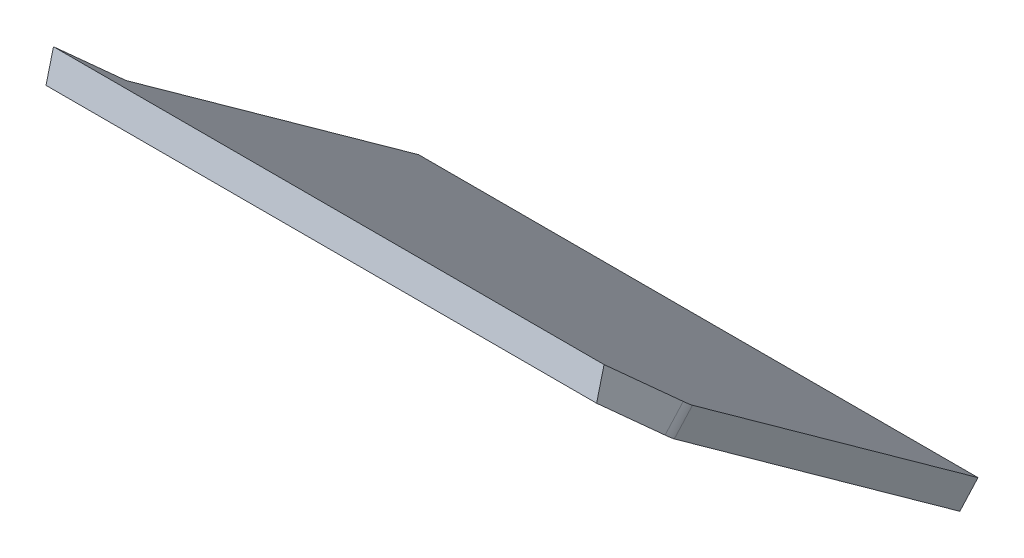
ISO-10303-21;
HEADER;
FILE_DESCRIPTION(('STEP AP214'),'2;1');
FILE_NAME('part.step','',(''),(''),'','','');
FILE_SCHEMA(('AUTOMOTIVE_DESIGN { 1 0 10303 214 1 1 1 1 }'));
ENDSEC;
DATA;
#1=APPLICATION_CONTEXT('core data for automotive mechanical design processes');
#2=APPLICATION_PROTOCOL_DEFINITION('international standard','automotive_design',2000,#1);
#3=PRODUCT_CONTEXT('',#1,'mechanical');
#4=PRODUCT('Part','Part','',(#3));
#5=PRODUCT_RELATED_PRODUCT_CATEGORY('part','',(#4));
#6=PRODUCT_DEFINITION_FORMATION('','',#4);
#7=PRODUCT_DEFINITION_CONTEXT('part definition',#1,'design');
#8=PRODUCT_DEFINITION('design','',#6,#7);
#9=PRODUCT_DEFINITION_SHAPE('','',#8);
#10=(LENGTH_UNIT() NAMED_UNIT(*) SI_UNIT(.MILLI.,.METRE.));
#11=(NAMED_UNIT(*) PLANE_ANGLE_UNIT() SI_UNIT($,.RADIAN.));
#12=(NAMED_UNIT(*) SI_UNIT($,.STERADIAN.) SOLID_ANGLE_UNIT());
#13=UNCERTAINTY_MEASURE_WITH_UNIT(LENGTH_MEASURE(1.E-05),#10,'distance_accuracy_value','');
#14=(GEOMETRIC_REPRESENTATION_CONTEXT(3) GLOBAL_UNCERTAINTY_ASSIGNED_CONTEXT((#13)) GLOBAL_UNIT_ASSIGNED_CONTEXT((#10,
#11,#12)) REPRESENTATION_CONTEXT('',''));
#15=CARTESIAN_POINT('',(0.,0.,0.));
#16=DIRECTION('',(0.,0.,1.));
#17=DIRECTION('',(1.,0.,0.));
#18=AXIS2_PLACEMENT_3D('',#15,#16,#17);
#19=CARTESIAN_POINT('',(348.107032654592,448.865571733116,468.354062900941));
#20=DIRECTION('',(-0.899556203820193,0.292744185464577,0.324190496537583));
#21=DIRECTION('',(0.339043731930305,0.,0.940770613826118));
#22=AXIS2_PLACEMENT_3D('',#19,#20,#21);
#23=PLANE('',#22);
#24=DIRECTION('',(0.,-0.742185809750003,0.670194168734504));
#25=VECTOR('',#24,1.);
#26=CARTESIAN_POINT('',(355.40753597471,457.531556944151,480.785939571646));
#27=LINE('',#26,#25);
#28=CARTESIAN_POINT('',(355.40753597471,457.531556944151,480.785939571646));
#29=VERTEX_POINT('',#28);
#30=CARTESIAN_POINT('',(355.40753597471,458.941709982675,479.512570651051));
#31=VERTEX_POINT('',#30);
#32=EDGE_CURVE('E52',#29,#31,#27,.F.);
#33=ORIENTED_EDGE('',*,*,#32,.T.);
#34=DIRECTION('',(-0.436805032215293,-0.602877322249239,-0.667637849547929));
#35=VECTOR('',#34,1.);
#36=CARTESIAN_POINT('',(348.107032654592,448.865571733116,468.354062900941));
#37=LINE('',#36,#35);
#38=CARTESIAN_POINT('',(393.295046173225,511.233966276814,537.422013006546));
#39=VERTEX_POINT('',#38);
#40=EDGE_CURVE('E115',#39,#31,#37,.T.);
#41=ORIENTED_EDGE('',*,*,#40,.F.);
#42=DIRECTION('',(0.,-0.742185809750003,0.670194168734504));
#43=VECTOR('',#42,1.);
#44=CARTESIAN_POINT('',(393.295046173225,511.233966276814,537.422013006546));
#45=LINE('',#44,#43);
#46=CARTESIAN_POINT('',(393.295046173225,509.823813238289,538.695381927141));
#47=VERTEX_POINT('',#46);
#48=EDGE_CURVE('E45',#39,#47,#45,.T.);
#49=ORIENTED_EDGE('',*,*,#48,.T.);
#50=DIRECTION('',(-0.436805032215293,-0.602877322249239,-0.667637849547929));
#51=VECTOR('',#50,1.);
#52=CARTESIAN_POINT('',(348.107032654592,447.455418694591,469.627431821537));
#53=LINE('',#52,#51);
#54=EDGE_CURVE('E137',#47,#29,#53,.T.);
#55=ORIENTED_EDGE('',*,*,#54,.T.);
#56=EDGE_LOOP('',(#33,#41,#49,#55));
#57=FACE_BOUND('',#56,.T.);
#58=ADVANCED_FACE('F37',(#57),#23,.F.);
#59=CARTESIAN_POINT('',(354.876732598708,512.346394181579,538.653936893388));
#60=DIRECTION('',(0.899556203820193,-0.292744185464577,-0.324190496537583));
#61=DIRECTION('',(-0.339043731930305,0.,-0.940770613826118));
#62=AXIS2_PLACEMENT_3D('',#59,#60,#61);
#63=PLANE('',#62);
#64=DIRECTION('',(0.,-0.742185809750003,0.670194168734504));
#65=VECTOR('',#64,1.);
#66=CARTESIAN_POINT('',(316.183230718561,457.531556944151,480.785939571647));
#67=LINE('',#66,#65);
#68=CARTESIAN_POINT('',(316.183230718561,457.531556944151,480.785939571647));
#69=VERTEX_POINT('',#68);
#70=CARTESIAN_POINT('',(316.18323071856,458.941709982676,479.512570651051));
#71=VERTEX_POINT('',#70);
#72=EDGE_CURVE('E99',#69,#71,#67,.F.);
#73=ORIENTED_EDGE('',*,*,#72,.F.);
#74=DIRECTION('',(0.436805032215294,0.60287732224924,0.667637849547929));
#75=VECTOR('',#74,1.);
#76=CARTESIAN_POINT('',(354.876732598708,510.936241143054,539.927305813984));
#77=LINE('',#76,#75);
#78=CARTESIAN_POINT('',(354.876732598708,510.936241143054,539.927305813984));
#79=VERTEX_POINT('',#78);
#80=EDGE_CURVE('E141',#69,#79,#77,.T.);
#81=ORIENTED_EDGE('',*,*,#80,.T.);
#82=DIRECTION('',(0.,-0.742185809750003,0.670194168734504));
#83=VECTOR('',#82,1.);
#84=CARTESIAN_POINT('',(354.876732598708,512.346394181579,538.653936893388));
#85=LINE('',#84,#83);
#86=CARTESIAN_POINT('',(354.876732598708,512.346394181579,538.653936893388));
#87=VERTEX_POINT('',#86);
#88=EDGE_CURVE('E119',#87,#79,#85,.T.);
#89=ORIENTED_EDGE('',*,*,#88,.F.);
#90=DIRECTION('',(0.436805032215294,0.60287732224924,0.667637849547929));
#91=VECTOR('',#90,1.);
#92=CARTESIAN_POINT('',(354.876732598708,512.346394181579,538.653936893388));
#93=LINE('',#92,#91);
#94=EDGE_CURVE('E112',#71,#87,#93,.T.);
#95=ORIENTED_EDGE('',*,*,#94,.F.);
#96=EDGE_LOOP('',(#73,#81,#89,#95));
#97=FACE_BOUND('',#96,.T.);
#98=ADVANCED_FACE('F117',(#97),#63,.F.);
#99=CARTESIAN_POINT('',(390.686333182146,512.082924414661,538.362165446505));
#100=DIRECTION('',(0.,0.742185809750003,-0.670194168734504));
#101=DIRECTION('',(0.,0.670194168734504,0.742185809750003));
#102=AXIS2_PLACEMENT_3D('',#99,#100,#101);
#103=PLANE('',#102);
#104=ORIENTED_EDGE('',*,*,#40,.T.);
#105=DIRECTION('',(1.,0.,0.));
#106=VECTOR('',#105,1.);
#107=CARTESIAN_POINT('',(390.686333182146,458.941709982676,479.512570651051));
#108=LINE('',#107,#106);
#109=EDGE_CURVE('E102',#71,#31,#108,.T.);
#110=ORIENTED_EDGE('',*,*,#109,.F.);
#111=ORIENTED_EDGE('',*,*,#94,.T.);
#112=CARTESIAN_POINT('',(353.977176394888,512.639138367044,538.978127389926));
#113=DIRECTION('',(0.,-0.742185809750003,0.670194168734504));
#114=DIRECTION('',(0.,0.670194168734504,0.742185809750003));
#115=AXIS2_PLACEMENT_3D('',#112,#113,#114);
#116=CIRCLE('',#115,1.00000000000055);
#117=CARTESIAN_POINT('',(354.977176394888,512.639138367044,538.978127389926));
#118=VERTEX_POINT('',#117);
#119=EDGE_CURVE('E121',#87,#118,#116,.T.);
#120=ORIENTED_EDGE('',*,*,#119,.T.);
#121=DIRECTION('',(-1.40057253798449E-13,0.670194168734504,0.742185809750003));
#122=VECTOR('',#121,1.);
#123=CARTESIAN_POINT('',(354.977176394887,519.545488948643,546.626351797042));
#124=LINE('',#123,#122);
#125=CARTESIAN_POINT('',(354.977176394887,517.095522129149,543.913211795808));
#126=VERTEX_POINT('',#125);
#127=EDGE_CURVE('E123',#118,#126,#124,.T.);
#128=ORIENTED_EDGE('',*,*,#127,.T.);
#129=DIRECTION('',(-1.,3.51348904500842E-13,3.88024527708059E-13));
#130=VECTOR('',#129,1.);
#131=CARTESIAN_POINT('',(390.68633318215,517.095522129136,543.913211795794));
#132=LINE('',#131,#130);
#133=CARTESIAN_POINT('',(393.58633318215,517.095522129135,543.913211795793));
#134=VERTEX_POINT('',#133);
#135=EDGE_CURVE('E138',#134,#126,#132,.T.);
#136=ORIENTED_EDGE('',*,*,#135,.F.);
#137=DIRECTION('',(-5.23458285282408E-13,-0.670194168734503,-0.742185809750003));
#138=VECTOR('',#137,1.);
#139=CARTESIAN_POINT('',(393.586333182152,519.545488948643,546.626351797042));
#140=LINE('',#139,#138);
#141=CARTESIAN_POINT('',(393.586333182146,512.082924414661,538.362165446505));
#142=VERTEX_POINT('',#141);
#143=EDGE_CURVE('E131',#134,#142,#140,.T.);
#144=ORIENTED_EDGE('',*,*,#143,.T.);
#145=CARTESIAN_POINT('',(390.686333182146,512.082924414661,538.362165446505));
#146=DIRECTION('',(0.,0.742185809750003,-0.670194168734504));
#147=DIRECTION('',(0.,0.670194168734504,0.742185809750003));
#148=AXIS2_PLACEMENT_3D('',#145,#146,#147);
#149=CIRCLE('',#148,2.89999999999995);
#150=EDGE_CURVE('E125',#142,#39,#149,.T.);
#151=ORIENTED_EDGE('',*,*,#150,.T.);
#152=EDGE_LOOP('',(#104,#110,#111,#120,#128,#136,#144,#151));
#153=FACE_BOUND('',#152,.T.);
#154=ADVANCED_FACE('F111',(#153),#103,.T.);
#155=CARTESIAN_POINT('',(390.686333182146,510.672771376136,539.6355343671));
#156=DIRECTION('',(0.,0.742185809750003,-0.670194168734504));
#157=DIRECTION('',(0.,0.670194168734504,0.742185809750003));
#158=AXIS2_PLACEMENT_3D('',#155,#156,#157);
#159=PLANE('',#158);
#160=DIRECTION('',(1.,0.,0.));
#161=VECTOR('',#160,1.);
#162=CARTESIAN_POINT('',(313.083149273775,457.531556944151,480.785939571646));
#163=LINE('',#162,#161);
#164=EDGE_CURVE('E103',#69,#29,#163,.T.);
#165=ORIENTED_EDGE('',*,*,#164,.T.);
#166=ORIENTED_EDGE('',*,*,#54,.F.);
#167=CARTESIAN_POINT('',(390.686333182146,510.672771376136,539.6355343671));
#168=DIRECTION('',(0.,0.742185809750003,-0.670194168734504));
#169=DIRECTION('',(0.,0.670194168734504,0.742185809750003));
#170=AXIS2_PLACEMENT_3D('',#167,#168,#169);
#171=CIRCLE('',#170,2.89999999999995);
#172=CARTESIAN_POINT('',(393.586333182146,510.672771376136,539.6355343671));
#173=VERTEX_POINT('',#172);
#174=EDGE_CURVE('E134',#173,#47,#171,.T.);
#175=ORIENTED_EDGE('',*,*,#174,.F.);
#176=DIRECTION('',(-5.23458285282408E-13,-0.670194168734503,-0.742185809750003));
#177=VECTOR('',#176,1.);
#178=CARTESIAN_POINT('',(393.586333182152,518.135335910118,547.899720717637));
#179=LINE('',#178,#177);
#180=CARTESIAN_POINT('',(393.586333182149,515.008306825545,544.436789045719));
#181=VERTEX_POINT('',#180);
#182=EDGE_CURVE('E148',#181,#173,#179,.T.);
#183=ORIENTED_EDGE('',*,*,#182,.F.);
#184=DIRECTION('',(-1.,3.51348904500842E-13,3.88024527708059E-13));
#185=VECTOR('',#184,1.);
#186=CARTESIAN_POINT('',(390.68633318215,515.008306825546,544.43678904572));
#187=LINE('',#186,#185);
#188=CARTESIAN_POINT('',(354.977176394887,515.008306825554,544.436789045729));
#189=VERTEX_POINT('',#188);
#190=EDGE_CURVE('E11',#181,#189,#187,.T.);
#191=ORIENTED_EDGE('',*,*,#190,.T.);
#192=DIRECTION('',(-1.40057253798449E-13,0.670194168734504,0.742185809750003));
#193=VECTOR('',#192,1.);
#194=CARTESIAN_POINT('',(354.977176394887,518.135335910118,547.899720717637));
#195=LINE('',#194,#193);
#196=CARTESIAN_POINT('',(354.977176394888,511.228985328519,540.251496310522));
#197=VERTEX_POINT('',#196);
#198=EDGE_CURVE('E145',#197,#189,#195,.T.);
#199=ORIENTED_EDGE('',*,*,#198,.F.);
#200=CARTESIAN_POINT('',(353.977176394888,511.228985328519,540.251496310522));
#201=DIRECTION('',(0.,-0.742185809750003,0.670194168734504));
#202=DIRECTION('',(0.,0.670194168734504,0.742185809750003));
#203=AXIS2_PLACEMENT_3D('',#200,#201,#202);
#204=CIRCLE('',#203,1.00000000000055);
#205=EDGE_CURVE('E143',#79,#197,#204,.T.);
#206=ORIENTED_EDGE('',*,*,#205,.F.);
#207=ORIENTED_EDGE('',*,*,#80,.F.);
#208=EDGE_LOOP('',(#165,#166,#175,#183,#191,#199,#206,#207));
#209=FACE_BOUND('',#208,.T.);
#210=ADVANCED_FACE('F164',(#209),#159,.F.);
#211=CARTESIAN_POINT('',(390.686333182146,512.082924414661,538.362165446505));
#212=DIRECTION('',(0.,-0.742185809750003,0.670194168734504));
#213=DIRECTION('',(0.,-0.670194168734504,-0.742185809750003));
#214=AXIS2_PLACEMENT_3D('',#211,#212,#213);
#215=CYLINDRICAL_SURFACE('',#214,2.89999999999995);
#216=ORIENTED_EDGE('',*,*,#174,.T.);
#217=ORIENTED_EDGE('',*,*,#48,.F.);
#218=ORIENTED_EDGE('',*,*,#150,.F.);
#219=DIRECTION('',(0.,-0.742185809750003,0.670194168734504));
#220=VECTOR('',#219,1.);
#221=CARTESIAN_POINT('',(393.586333182146,512.082924414661,538.362165446505));
#222=LINE('',#221,#220);
#223=EDGE_CURVE('E133',#142,#173,#222,.T.);
#224=ORIENTED_EDGE('',*,*,#223,.T.);
#225=EDGE_LOOP('',(#216,#217,#218,#224));
#226=FACE_BOUND('',#225,.T.);
#227=ADVANCED_FACE('F39',(#226),#215,.T.);
#228=CARTESIAN_POINT('',(353.977176394888,512.639138367044,538.978127389926));
#229=DIRECTION('',(0.,-0.742185809750003,0.670194168734504));
#230=DIRECTION('',(0.,-0.670194168734504,-0.742185809750003));
#231=AXIS2_PLACEMENT_3D('',#228,#229,#230);
#232=CYLINDRICAL_SURFACE('',#231,1.00000000000055);
#233=ORIENTED_EDGE('',*,*,#205,.T.);
#234=DIRECTION('',(0.,-0.742185809750003,0.670194168734504));
#235=VECTOR('',#234,1.);
#236=CARTESIAN_POINT('',(354.977176394888,512.639138367044,538.978127389926));
#237=LINE('',#236,#235);
#238=EDGE_CURVE('E152',#118,#197,#237,.T.);
#239=ORIENTED_EDGE('',*,*,#238,.F.);
#240=ORIENTED_EDGE('',*,*,#119,.F.);
#241=ORIENTED_EDGE('',*,*,#88,.T.);
#242=EDGE_LOOP('',(#233,#239,#240,#241));
#243=FACE_BOUND('',#242,.T.);
#244=ADVANCED_FACE('F183',(#243),#232,.F.);
#245=CARTESIAN_POINT('',(354.977176394887,519.545488948643,546.626351797042));
#246=DIRECTION('',(1.,0.,1.04427289950221E-13));
#247=DIRECTION('',(1.04427289950221E-13,0.,-1.));
#248=AXIS2_PLACEMENT_3D('',#245,#246,#247);
#249=PLANE('',#248);
#250=ORIENTED_EDGE('',*,*,#198,.T.);
#251=DIRECTION('',(0.,0.969948277938595,-0.243311196051383));
#252=VECTOR('',#251,1.);
#253=CARTESIAN_POINT('',(354.977176394887,518.760151009608,543.495640206582));
#254=LINE('',#253,#252);
#255=EDGE_CURVE('E60',#189,#126,#254,.T.);
#256=ORIENTED_EDGE('',*,*,#255,.T.);
#257=ORIENTED_EDGE('',*,*,#127,.F.);
#258=ORIENTED_EDGE('',*,*,#238,.T.);
#259=EDGE_LOOP('',(#250,#256,#257,#258));
#260=FACE_BOUND('',#259,.T.);
#261=ADVANCED_FACE('F179',(#260),#249,.F.);
#262=CARTESIAN_POINT('',(393.586333182152,519.545488948643,546.626351797042));
#263=DIRECTION('',(-1.,3.5134890449737E-13,3.88024527704214E-13));
#264=DIRECTION('',(3.88024527704214E-13,0.,1.));
#265=AXIS2_PLACEMENT_3D('',#262,#263,#264);
#266=PLANE('',#265);
#267=ORIENTED_EDGE('',*,*,#143,.F.);
#268=DIRECTION('',(2.4791405854624E-13,0.969948277938595,-0.243311196051382));
#269=VECTOR('',#268,1.);
#270=CARTESIAN_POINT('',(393.586333182147,505.418101772733,546.842488725641));
#271=LINE('',#270,#269);
#272=EDGE_CURVE('E107',#181,#134,#271,.T.);
#273=ORIENTED_EDGE('',*,*,#272,.F.);
#274=ORIENTED_EDGE('',*,*,#182,.T.);
#275=ORIENTED_EDGE('',*,*,#223,.F.);
#276=EDGE_LOOP('',(#267,#273,#274,#275));
#277=FACE_BOUND('',#276,.T.);
#278=ADVANCED_FACE('F175',(#277),#266,.F.);
#279=CARTESIAN_POINT('',(342.586333182147,505.418101772751,546.842488725661));
#280=DIRECTION('',(-4.61850844633811E-13,-0.243311196051383,-0.969948277938595));
#281=DIRECTION('',(0.,0.969948277938595,-0.243311196051383));
#282=AXIS2_PLACEMENT_3D('',#279,#280,#281);
#283=PLANE('',#282);
#284=ORIENTED_EDGE('',*,*,#135,.T.);
#285=ORIENTED_EDGE('',*,*,#255,.F.);
#286=ORIENTED_EDGE('',*,*,#190,.F.);
#287=ORIENTED_EDGE('',*,*,#272,.T.);
#288=EDGE_LOOP('',(#284,#285,#286,#287));
#289=FACE_BOUND('',#288,.T.);
#290=ADVANCED_FACE('F176',(#289),#283,.F.);
#291=CARTESIAN_POINT('',(313.083149273775,457.531556944151,480.785939571646));
#292=DIRECTION('',(0.,0.670194168734504,0.742185809750003));
#293=DIRECTION('',(1.,0.,0.));
#294=AXIS2_PLACEMENT_3D('',#291,#292,#293);
#295=PLANE('',#294);
#296=ORIENTED_EDGE('',*,*,#164,.F.);
#297=ORIENTED_EDGE('',*,*,#72,.T.);
#298=ORIENTED_EDGE('',*,*,#109,.T.);
#299=ORIENTED_EDGE('',*,*,#32,.F.);
#300=EDGE_LOOP('',(#296,#297,#298,#299));
#301=FACE_BOUND('',#300,.T.);
#302=ADVANCED_FACE('F101',(#301),#295,.F.);
#303=CLOSED_SHELL('',(#58,#98,#154,#210,#227,#244,#261,#278,#290,#302));
#304=MANIFOLD_SOLID_BREP('B2',#303);
#305=ADVANCED_BREP_SHAPE_REPRESENTATION('',(#18,#304),#14);
#306=SHAPE_DEFINITION_REPRESENTATION(#9,#305);
ENDSEC;
END-ISO-10303-21;
